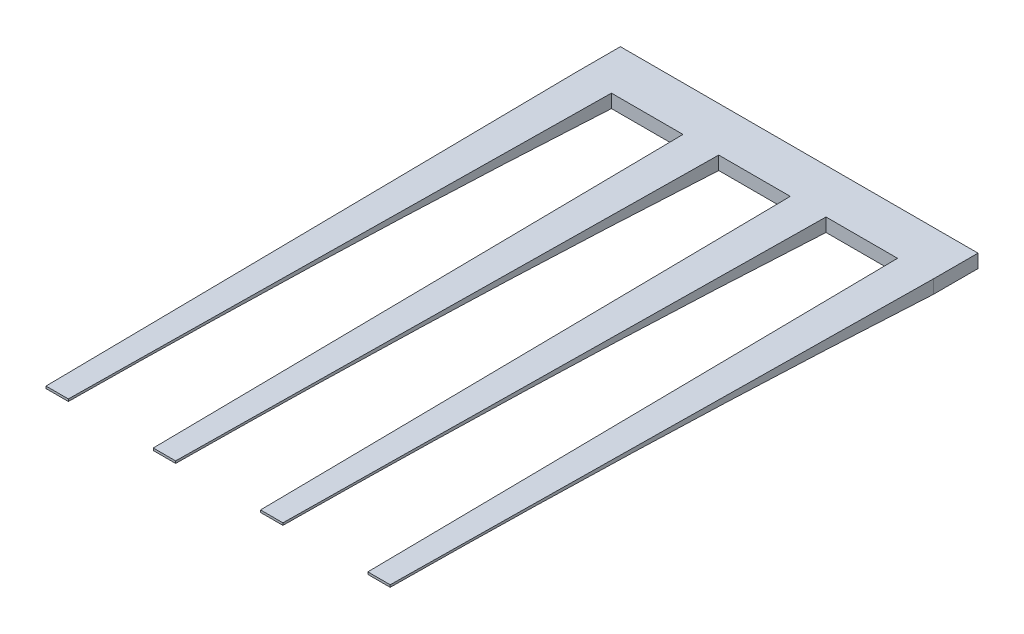
ISO-10303-21;
HEADER;
FILE_DESCRIPTION(('STEP AP214'),'2;1');
FILE_NAME('part.step','',(''),(''),'','','');
FILE_SCHEMA(('AUTOMOTIVE_DESIGN { 1 0 10303 214 1 1 1 1 }'));
ENDSEC;
DATA;
#1=APPLICATION_CONTEXT('core data for automotive mechanical design processes');
#2=APPLICATION_PROTOCOL_DEFINITION('international standard','automotive_design',2000,#1);
#3=PRODUCT_CONTEXT('',#1,'mechanical');
#4=PRODUCT('Part','Part','',(#3));
#5=PRODUCT_RELATED_PRODUCT_CATEGORY('part','',(#4));
#6=PRODUCT_DEFINITION_FORMATION('','',#4);
#7=PRODUCT_DEFINITION_CONTEXT('part definition',#1,'design');
#8=PRODUCT_DEFINITION('design','',#6,#7);
#9=PRODUCT_DEFINITION_SHAPE('','',#8);
#10=(LENGTH_UNIT() NAMED_UNIT(*) SI_UNIT(.MILLI.,.METRE.));
#11=(NAMED_UNIT(*) PLANE_ANGLE_UNIT() SI_UNIT($,.RADIAN.));
#12=(NAMED_UNIT(*) SI_UNIT($,.STERADIAN.) SOLID_ANGLE_UNIT());
#13=UNCERTAINTY_MEASURE_WITH_UNIT(LENGTH_MEASURE(1.E-05),#10,'distance_accuracy_value','');
#14=(GEOMETRIC_REPRESENTATION_CONTEXT(3) GLOBAL_UNCERTAINTY_ASSIGNED_CONTEXT((#13)) GLOBAL_UNIT_ASSIGNED_CONTEXT((#10,
#11,#12)) REPRESENTATION_CONTEXT('',''));
#15=CARTESIAN_POINT('',(0.,0.,0.));
#16=DIRECTION('',(0.,0.,1.));
#17=DIRECTION('',(1.,0.,0.));
#18=AXIS2_PLACEMENT_3D('',#15,#16,#17);
#19=CARTESIAN_POINT('',(0.,0.,200.));
#20=DIRECTION('',(0.,0.,1.));
#21=DIRECTION('',(1.,0.,0.));
#22=AXIS2_PLACEMENT_3D('',#19,#20,#21);
#23=PLANE('',#22);
#24=DIRECTION('',(0.,-1.,0.));
#25=VECTOR('',#24,1.);
#26=CARTESIAN_POINT('',(960.,0.,200.));
#27=LINE('',#26,#25);
#28=CARTESIAN_POINT('',(960.,0.,200.));
#29=VERTEX_POINT('',#28);
#30=CARTESIAN_POINT('',(960.,-60.,200.));
#31=VERTEX_POINT('',#30);
#32=EDGE_CURVE('E310',#29,#31,#27,.T.);
#33=ORIENTED_EDGE('',*,*,#32,.F.);
#34=DIRECTION('',(-1.,0.,0.));
#35=VECTOR('',#34,1.);
#36=CARTESIAN_POINT('',(0.,0.,200.));
#37=LINE('',#36,#35);
#38=CARTESIAN_POINT('',(640.,0.,200.));
#39=VERTEX_POINT('',#38);
#40=EDGE_CURVE('E209',#29,#39,#37,.T.);
#41=ORIENTED_EDGE('',*,*,#40,.T.);
#42=DIRECTION('',(0.,1.,0.));
#43=VECTOR('',#42,1.);
#44=CARTESIAN_POINT('',(640.,0.,200.));
#45=LINE('',#44,#43);
#46=CARTESIAN_POINT('',(640.,-60.,200.));
#47=VERTEX_POINT('',#46);
#48=EDGE_CURVE('E498',#47,#39,#45,.T.);
#49=ORIENTED_EDGE('',*,*,#48,.F.);
#50=DIRECTION('',(1.,0.,0.));
#51=VECTOR('',#50,1.);
#52=CARTESIAN_POINT('',(0.,-60.,200.));
#53=LINE('',#52,#51);
#54=EDGE_CURVE('E487',#47,#31,#53,.T.);
#55=ORIENTED_EDGE('',*,*,#54,.T.);
#56=EDGE_LOOP('',(#33,#41,#49,#55));
#57=FACE_BOUND('',#56,.T.);
#58=ADVANCED_FACE('F70',(#57),#23,.T.);
#59=DIRECTION('',(0.,-1.,0.));
#60=VECTOR('',#59,1.);
#61=CARTESIAN_POINT('',(480.,0.,200.));
#62=LINE('',#61,#60);
#63=CARTESIAN_POINT('',(480.,0.,200.));
#64=VERTEX_POINT('',#63);
#65=CARTESIAN_POINT('',(480.,-60.,200.));
#66=VERTEX_POINT('',#65);
#67=EDGE_CURVE('E556',#64,#66,#62,.T.);
#68=ORIENTED_EDGE('',*,*,#67,.F.);
#69=CARTESIAN_POINT('',(160.,0.,200.));
#70=VERTEX_POINT('',#69);
#71=EDGE_CURVE('E468',#64,#70,#37,.T.);
#72=ORIENTED_EDGE('',*,*,#71,.T.);
#73=DIRECTION('',(0.,1.,0.));
#74=VECTOR('',#73,1.);
#75=CARTESIAN_POINT('',(160.,0.,200.));
#76=LINE('',#75,#74);
#77=CARTESIAN_POINT('',(160.,-60.,200.));
#78=VERTEX_POINT('',#77);
#79=EDGE_CURVE('E661',#78,#70,#76,.T.);
#80=ORIENTED_EDGE('',*,*,#79,.F.);
#81=EDGE_CURVE('E484',#78,#66,#53,.T.);
#82=ORIENTED_EDGE('',*,*,#81,.T.);
#83=EDGE_LOOP('',(#68,#72,#80,#82));
#84=FACE_BOUND('',#83,.T.);
#85=ADVANCED_FACE('F698',(#84),#23,.T.);
#86=DIRECTION('',(0.,-1.,0.));
#87=VECTOR('',#86,1.);
#88=CARTESIAN_POINT('',(1440.,0.,200.));
#89=LINE('',#88,#87);
#90=CARTESIAN_POINT('',(1440.,0.,200.));
#91=VERTEX_POINT('',#90);
#92=CARTESIAN_POINT('',(1440.,-60.,200.));
#93=VERTEX_POINT('',#92);
#94=EDGE_CURVE('E212',#91,#93,#89,.T.);
#95=ORIENTED_EDGE('',*,*,#94,.F.);
#96=CARTESIAN_POINT('',(1120.,0.,200.));
#97=VERTEX_POINT('',#96);
#98=EDGE_CURVE('E200',#91,#97,#37,.T.);
#99=ORIENTED_EDGE('',*,*,#98,.T.);
#100=DIRECTION('',(0.,1.,0.));
#101=VECTOR('',#100,1.);
#102=CARTESIAN_POINT('',(1120.,0.,200.));
#103=LINE('',#102,#101);
#104=CARTESIAN_POINT('',(1120.,-60.,200.));
#105=VERTEX_POINT('',#104);
#106=EDGE_CURVE('E97',#105,#97,#103,.T.);
#107=ORIENTED_EDGE('',*,*,#106,.F.);
#108=EDGE_CURVE('E214',#105,#93,#53,.T.);
#109=ORIENTED_EDGE('',*,*,#108,.T.);
#110=EDGE_LOOP('',(#95,#99,#107,#109));
#111=FACE_BOUND('',#110,.T.);
#112=ADVANCED_FACE('F213',(#111),#23,.T.);
#113=CARTESIAN_POINT('',(0.,0.,200.));
#114=DIRECTION('',(1.,0.,0.));
#115=DIRECTION('',(0.,0.,-1.));
#116=AXIS2_PLACEMENT_3D('',#113,#114,#115);
#117=PLANE('',#116);
#118=DIRECTION('',(0.,-1.,0.));
#119=VECTOR('',#118,1.);
#120=CARTESIAN_POINT('',(0.,0.,0.));
#121=LINE('',#120,#119);
#122=CARTESIAN_POINT('',(0.,0.,0.));
#123=VERTEX_POINT('',#122);
#124=CARTESIAN_POINT('',(0.,-60.,0.));
#125=VERTEX_POINT('',#124);
#126=EDGE_CURVE('E475',#123,#125,#121,.T.);
#127=ORIENTED_EDGE('',*,*,#126,.T.);
#128=DIRECTION('',(0.,0.,-1.));
#129=VECTOR('',#128,1.);
#130=CARTESIAN_POINT('',(0.,-60.,200.));
#131=LINE('',#130,#129);
#132=CARTESIAN_POINT('',(0.,-60.,200.));
#133=VERTEX_POINT('',#132);
#134=EDGE_CURVE('E12',#133,#125,#131,.T.);
#135=ORIENTED_EDGE('',*,*,#134,.F.);
#136=DIRECTION('',(0.,-1.,0.));
#137=VECTOR('',#136,1.);
#138=CARTESIAN_POINT('',(0.,0.,200.));
#139=LINE('',#138,#137);
#140=CARTESIAN_POINT('',(-1.51961776495568E-12,0.,199.999999999757));
#141=VERTEX_POINT('',#140);
#142=EDGE_CURVE('E850',#141,#133,#139,.T.);
#143=ORIENTED_EDGE('',*,*,#142,.F.);
#144=DIRECTION('',(0.,0.,-1.));
#145=VECTOR('',#144,1.);
#146=CARTESIAN_POINT('',(0.,0.,200.));
#147=LINE('',#146,#145);
#148=EDGE_CURVE('E208',#141,#123,#147,.T.);
#149=ORIENTED_EDGE('',*,*,#148,.T.);
#150=EDGE_LOOP('',(#127,#135,#143,#149));
#151=FACE_BOUND('',#150,.T.);
#152=ADVANCED_FACE('F72',(#151),#117,.F.);
#153=CARTESIAN_POINT('',(0.,-60.,200.));
#154=DIRECTION('',(0.,1.,0.));
#155=DIRECTION('',(0.,0.,1.));
#156=AXIS2_PLACEMENT_3D('',#153,#154,#155);
#157=PLANE('',#156);
#158=DIRECTION('',(1.,0.,0.));
#159=VECTOR('',#158,1.);
#160=CARTESIAN_POINT('',(0.,-60.,0.));
#161=LINE('',#160,#159);
#162=CARTESIAN_POINT('',(1600.,-60.,0.));
#163=VERTEX_POINT('',#162);
#164=EDGE_CURVE('E719',#125,#163,#161,.T.);
#165=ORIENTED_EDGE('',*,*,#164,.T.);
#166=DIRECTION('',(0.,0.,-1.));
#167=VECTOR('',#166,1.);
#168=CARTESIAN_POINT('',(1600.,-60.,200.));
#169=LINE('',#168,#167);
#170=CARTESIAN_POINT('',(1600.,-60.,200.));
#171=VERTEX_POINT('',#170);
#172=EDGE_CURVE('E81',#171,#163,#169,.T.);
#173=ORIENTED_EDGE('',*,*,#172,.F.);
#174=DIRECTION('',(1.,0.,0.));
#175=VECTOR('',#174,1.);
#176=CARTESIAN_POINT('',(1440.,-60.,200.));
#177=LINE('',#176,#175);
#178=EDGE_CURVE('E89',#93,#171,#177,.T.);
#179=ORIENTED_EDGE('',*,*,#178,.F.);
#180=ORIENTED_EDGE('',*,*,#108,.F.);
#181=DIRECTION('',(1.,0.,0.));
#182=VECTOR('',#181,1.);
#183=CARTESIAN_POINT('',(960.,-60.,200.));
#184=LINE('',#183,#182);
#185=EDGE_CURVE('E366',#31,#105,#184,.T.);
#186=ORIENTED_EDGE('',*,*,#185,.F.);
#187=ORIENTED_EDGE('',*,*,#54,.F.);
#188=DIRECTION('',(1.,0.,0.));
#189=VECTOR('',#188,1.);
#190=CARTESIAN_POINT('',(480.,-60.,200.));
#191=LINE('',#190,#189);
#192=EDGE_CURVE('E494',#66,#47,#191,.T.);
#193=ORIENTED_EDGE('',*,*,#192,.F.);
#194=ORIENTED_EDGE('',*,*,#81,.F.);
#195=DIRECTION('',(1.,0.,0.));
#196=VECTOR('',#195,1.);
#197=CARTESIAN_POINT('',(0.,-60.,200.));
#198=LINE('',#197,#196);
#199=EDGE_CURVE('E483',#133,#78,#198,.T.);
#200=ORIENTED_EDGE('',*,*,#199,.F.);
#201=ORIENTED_EDGE('',*,*,#134,.T.);
#202=EDGE_LOOP('',(#165,#173,#179,#180,#186,#187,#193,#194,#200,#201));
#203=FACE_BOUND('',#202,.T.);
#204=ADVANCED_FACE('F500',(#203),#157,.F.);
#205=CARTESIAN_POINT('',(1600.,0.,200.));
#206=DIRECTION('',(-1.,0.,0.));
#207=DIRECTION('',(0.,0.,1.));
#208=AXIS2_PLACEMENT_3D('',#205,#206,#207);
#209=PLANE('',#208);
#210=DIRECTION('',(0.,1.,0.));
#211=VECTOR('',#210,1.);
#212=CARTESIAN_POINT('',(1600.,0.,0.));
#213=LINE('',#212,#211);
#214=CARTESIAN_POINT('',(1600.,0.,0.));
#215=VERTEX_POINT('',#214);
#216=EDGE_CURVE('E721',#163,#215,#213,.T.);
#217=ORIENTED_EDGE('',*,*,#216,.T.);
#218=DIRECTION('',(0.,0.,-1.));
#219=VECTOR('',#218,1.);
#220=CARTESIAN_POINT('',(1600.,0.,200.));
#221=LINE('',#220,#219);
#222=CARTESIAN_POINT('',(1600.,0.,200.));
#223=VERTEX_POINT('',#222);
#224=EDGE_CURVE('E1007',#223,#215,#221,.T.);
#225=ORIENTED_EDGE('',*,*,#224,.F.);
#226=CARTESIAN_POINT('',(1600.,-60.,200.));
#227=DIRECTION('',(0.,1.,0.));
#228=VECTOR('',#227,1.);
#229=LINE('',#226,#228);
#230=EDGE_CURVE('E482',#171,#223,#229,.T.);
#231=ORIENTED_EDGE('',*,*,#230,.F.);
#232=ORIENTED_EDGE('',*,*,#172,.T.);
#233=EDGE_LOOP('',(#217,#225,#231,#232));
#234=FACE_BOUND('',#233,.T.);
#235=ADVANCED_FACE('F444',(#234),#209,.F.);
#236=CARTESIAN_POINT('',(0.,0.,200.));
#237=DIRECTION('',(0.,-1.,0.));
#238=DIRECTION('',(0.,0.,-1.));
#239=AXIS2_PLACEMENT_3D('',#236,#237,#238);
#240=PLANE('',#239);
#241=DIRECTION('',(-1.,0.,0.));
#242=VECTOR('',#241,1.);
#243=CARTESIAN_POINT('',(0.,0.,0.));
#244=LINE('',#243,#242);
#245=EDGE_CURVE('E851',#215,#123,#244,.T.);
#246=ORIENTED_EDGE('',*,*,#245,.T.);
#247=ORIENTED_EDGE('',*,*,#148,.F.);
#248=DIRECTION('',(0.012499023551926,0.,0.999921884154082));
#249=VECTOR('',#248,1.);
#250=CARTESIAN_POINT('',(14.9982918815874,0.,1399.86335052699));
#251=LINE('',#250,#249);
#252=CARTESIAN_POINT('',(30.,0.,2600.));
#253=VERTEX_POINT('',#252);
#254=EDGE_CURVE('E794',#141,#253,#251,.T.);
#255=ORIENTED_EDGE('',*,*,#254,.T.);
#256=DIRECTION('',(-1.,0.,0.));
#257=VECTOR('',#256,1.);
#258=CARTESIAN_POINT('',(30.,0.,2600.));
#259=LINE('',#258,#257);
#260=CARTESIAN_POINT('',(130.,0.,2600.));
#261=VERTEX_POINT('',#260);
#262=EDGE_CURVE('E720',#261,#253,#259,.T.);
#263=ORIENTED_EDGE('',*,*,#262,.F.);
#264=DIRECTION('',(0.012499023551926,0.,-0.999921884154082));
#265=VECTOR('',#264,1.);
#266=CARTESIAN_POINT('',(145.001708118413,0.,1399.86335052699));
#267=LINE('',#266,#265);
#268=EDGE_CURVE('E625',#261,#70,#267,.T.);
#269=ORIENTED_EDGE('',*,*,#268,.T.);
#270=ORIENTED_EDGE('',*,*,#71,.F.);
#271=DIRECTION('',(0.012499023551926,0.,0.999921884154082));
#272=VECTOR('',#271,1.);
#273=CARTESIAN_POINT('',(494.998291881587,0.,1399.86335052699));
#274=LINE('',#273,#272);
#275=CARTESIAN_POINT('',(510.,0.,2600.));
#276=VERTEX_POINT('',#275);
#277=EDGE_CURVE('E577',#64,#276,#274,.T.);
#278=ORIENTED_EDGE('',*,*,#277,.T.);
#279=DIRECTION('',(-1.,0.,0.));
#280=VECTOR('',#279,1.);
#281=CARTESIAN_POINT('',(510.,0.,2600.));
#282=LINE('',#281,#280);
#283=CARTESIAN_POINT('',(610.,0.,2600.));
#284=VERTEX_POINT('',#283);
#285=EDGE_CURVE('E603',#284,#276,#282,.T.);
#286=ORIENTED_EDGE('',*,*,#285,.F.);
#287=DIRECTION('',(0.012499023551926,0.,-0.999921884154082));
#288=VECTOR('',#287,1.);
#289=CARTESIAN_POINT('',(625.001708118413,0.,1399.86335052699));
#290=LINE('',#289,#288);
#291=EDGE_CURVE('E570',#284,#39,#290,.T.);
#292=ORIENTED_EDGE('',*,*,#291,.T.);
#293=ORIENTED_EDGE('',*,*,#40,.F.);
#294=DIRECTION('',(0.012499023551926,0.,0.999921884154082));
#295=VECTOR('',#294,1.);
#296=CARTESIAN_POINT('',(974.998291881587,0.,1399.86335052699));
#297=LINE('',#296,#295);
#298=CARTESIAN_POINT('',(990.,0.,2600.));
#299=VERTEX_POINT('',#298);
#300=EDGE_CURVE('E343',#29,#299,#297,.T.);
#301=ORIENTED_EDGE('',*,*,#300,.T.);
#302=DIRECTION('',(-1.,0.,0.));
#303=VECTOR('',#302,1.);
#304=CARTESIAN_POINT('',(990.,0.,2600.));
#305=LINE('',#304,#303);
#306=CARTESIAN_POINT('',(1090.,0.,2600.));
#307=VERTEX_POINT('',#306);
#308=EDGE_CURVE('E429',#307,#299,#305,.T.);
#309=ORIENTED_EDGE('',*,*,#308,.F.);
#310=DIRECTION('',(0.012499023551926,0.,-0.999921884154082));
#311=VECTOR('',#310,1.);
#312=CARTESIAN_POINT('',(1105.00170811841,0.,1399.86335052699));
#313=LINE('',#312,#311);
#314=EDGE_CURVE('E207',#307,#97,#313,.T.);
#315=ORIENTED_EDGE('',*,*,#314,.T.);
#316=ORIENTED_EDGE('',*,*,#98,.F.);
#317=DIRECTION('',(0.012499023551926,0.,0.999921884154082));
#318=VECTOR('',#317,1.);
#319=CARTESIAN_POINT('',(1454.99829188159,0.,1399.86335052699));
#320=LINE('',#319,#318);
#321=CARTESIAN_POINT('',(1470.,0.,2600.));
#322=VERTEX_POINT('',#321);
#323=EDGE_CURVE('E205',#91,#322,#320,.T.);
#324=ORIENTED_EDGE('',*,*,#323,.T.);
#325=DIRECTION('',(-1.,0.,0.));
#326=VECTOR('',#325,1.);
#327=CARTESIAN_POINT('',(1470.,0.,2600.));
#328=LINE('',#327,#326);
#329=CARTESIAN_POINT('',(1570.,0.,2600.));
#330=VERTEX_POINT('',#329);
#331=EDGE_CURVE('E306',#330,#322,#328,.T.);
#332=ORIENTED_EDGE('',*,*,#331,.F.);
#333=DIRECTION('',(0.012499023551926,0.,-0.999921884154082));
#334=VECTOR('',#333,1.);
#335=CARTESIAN_POINT('',(1585.00170811841,0.,1399.86335052699));
#336=LINE('',#335,#334);
#337=EDGE_CURVE('E225',#330,#223,#336,.T.);
#338=ORIENTED_EDGE('',*,*,#337,.T.);
#339=ORIENTED_EDGE('',*,*,#224,.T.);
#340=EDGE_LOOP('',(#246,#247,#255,#263,#269,#270,#278,#286,#292,#293,#301,#309,#315,#316,#324,
#332,#338,#339));
#341=FACE_BOUND('',#340,.T.);
#342=ADVANCED_FACE('F202',(#341),#240,.F.);
#343=CARTESIAN_POINT('',(0.,0.,0.));
#344=DIRECTION('',(0.,0.,1.));
#345=DIRECTION('',(1.,0.,0.));
#346=AXIS2_PLACEMENT_3D('',#343,#344,#345);
#347=PLANE('',#346);
#348=ORIENTED_EDGE('',*,*,#126,.F.);
#349=ORIENTED_EDGE('',*,*,#245,.F.);
#350=ORIENTED_EDGE('',*,*,#216,.F.);
#351=ORIENTED_EDGE('',*,*,#164,.F.);
#352=EDGE_LOOP('',(#348,#349,#350,#351));
#353=FACE_BOUND('',#352,.T.);
#354=ADVANCED_FACE('F443',(#353),#347,.F.);
#355=CARTESIAN_POINT('',(0.,0.,2600.));
#356=DIRECTION('',(0.,0.,1.));
#357=DIRECTION('',(1.,0.,0.));
#358=AXIS2_PLACEMENT_3D('',#355,#356,#357);
#359=PLANE('',#358);
#360=DIRECTION('',(0.,-1.,0.));
#361=VECTOR('',#360,1.);
#362=CARTESIAN_POINT('',(30.,0.,2600.));
#363=LINE('',#362,#361);
#364=CARTESIAN_POINT('',(30.,-10.,2600.));
#365=VERTEX_POINT('',#364);
#366=EDGE_CURVE('E745',#253,#365,#363,.T.);
#367=ORIENTED_EDGE('',*,*,#366,.T.);
#368=DIRECTION('',(1.,0.,0.));
#369=VECTOR('',#368,1.);
#370=CARTESIAN_POINT('',(30.,-10.,2600.));
#371=LINE('',#370,#369);
#372=CARTESIAN_POINT('',(130.,-10.,2600.));
#373=VERTEX_POINT('',#372);
#374=EDGE_CURVE('E730',#365,#373,#371,.T.);
#375=ORIENTED_EDGE('',*,*,#374,.T.);
#376=DIRECTION('',(0.,1.,0.));
#377=VECTOR('',#376,1.);
#378=CARTESIAN_POINT('',(130.,0.,2600.));
#379=LINE('',#378,#377);
#380=EDGE_CURVE('E722',#373,#261,#379,.T.);
#381=ORIENTED_EDGE('',*,*,#380,.T.);
#382=ORIENTED_EDGE('',*,*,#262,.T.);
#383=EDGE_LOOP('',(#367,#375,#381,#382));
#384=FACE_BOUND('',#383,.T.);
#385=ADVANCED_FACE('F746',(#384),#359,.T.);
#386=CARTESIAN_POINT('',(0.,0.,200.));
#387=DIRECTION('',(-0.999921884154081,0.,0.012499023551926));
#388=DIRECTION('',(0.,-1.,0.));
#389=AXIS2_PLACEMENT_3D('',#386,#387,#388);
#390=PLANE('',#389);
#391=ORIENTED_EDGE('',*,*,#142,.T.);
#392=CARTESIAN_POINT('',(0.,-60.,200.));
#393=CARTESIAN_POINT('',(4.99869868480411,-41.6688355253265,599.895894784329));
#394=CARTESIAN_POINT('',(14.9990238239833,-15.0016268303537,1399.92190591866));
#395=CARTESIAN_POINT('',(24.9986986848041,-8.33550219199315,2199.89589478433));
#396=CARTESIAN_POINT('',(30.,-10.,2600.));
#397=B_SPLINE_CURVE_WITH_KNOTS('',3,(#392,#393,#394,#395,#396),.UNSPECIFIED.,.F.,.F.,(4,1,4),
(0.,0.500056937280421,1.),.UNSPECIFIED.);
#398=EDGE_CURVE('E790',#133,#365,#397,.T.);
#399=ORIENTED_EDGE('',*,*,#398,.T.);
#400=ORIENTED_EDGE('',*,*,#366,.F.);
#401=ORIENTED_EDGE('',*,*,#254,.F.);
#402=EDGE_LOOP('',(#391,#399,#400,#401));
#403=FACE_BOUND('',#402,.T.);
#404=ADVANCED_FACE('F643',(#403),#390,.T.);
#405=CARTESIAN_POINT('',(160.,-60.,200.));
#406=DIRECTION('',(0.999921884154081,0.,0.012499023551926));
#407=DIRECTION('',(0.,1.,0.));
#408=AXIS2_PLACEMENT_3D('',#405,#406,#407);
#409=PLANE('',#408);
#410=ORIENTED_EDGE('',*,*,#79,.T.);
#411=ORIENTED_EDGE('',*,*,#268,.F.);
#412=ORIENTED_EDGE('',*,*,#380,.F.);
#413=CARTESIAN_POINT('',(160.,-60.,200.));
#414=CARTESIAN_POINT('',(155.001301315196,-41.6688355253265,599.895894784329));
#415=CARTESIAN_POINT('',(145.000976176017,-15.0016268303537,1399.92190591866));
#416=CARTESIAN_POINT('',(135.001301315196,-8.33550219199315,2199.89589478433));
#417=CARTESIAN_POINT('',(130.,-10.,2600.));
#418=B_SPLINE_CURVE_WITH_KNOTS('',3,(#413,#414,#415,#416,#417),.UNSPECIFIED.,.F.,.F.,(4,1,4),
(0.,0.500056937280421,1.),.UNSPECIFIED.);
#419=EDGE_CURVE('E788',#78,#373,#418,.T.);
#420=ORIENTED_EDGE('',*,*,#419,.F.);
#421=EDGE_LOOP('',(#410,#411,#412,#420));
#422=FACE_BOUND('',#421,.T.);
#423=ADVANCED_FACE('F829',(#422),#409,.T.);
#424=CARTESIAN_POINT('',(0.,-60.,200.));
#425=CARTESIAN_POINT('',(4.99869868480411,-41.6688355253265,599.895894784329));
#426=CARTESIAN_POINT('',(14.9990238239833,-15.0016268303537,1399.92190591866));
#427=CARTESIAN_POINT('',(24.9986986848041,-8.33550219199315,2199.89589478433));
#428=CARTESIAN_POINT('',(30.,-10.,2600.));
#429=CARTESIAN_POINT('',(53.3333333333333,-60.,200.));
#430=CARTESIAN_POINT('',(54.999566228268,-41.6688355253265,599.895894784329));
#431=CARTESIAN_POINT('',(58.3330079413278,-15.0016268303537,1399.92190591866));
#432=CARTESIAN_POINT('',(61.6662328949347,-8.33550219199315,2199.89589478433));
#433=CARTESIAN_POINT('',(63.3333333333333,-10.,2600.));
#434=CARTESIAN_POINT('',(106.666666666667,-60.,200.));
#435=CARTESIAN_POINT('',(105.000433771732,-41.6688355253265,599.895894784329));
#436=CARTESIAN_POINT('',(101.666992058672,-15.0016268303537,1399.92190591866));
#437=CARTESIAN_POINT('',(98.3337671050653,-8.33550219199315,2199.89589478433));
#438=CARTESIAN_POINT('',(96.6666666666667,-10.,2600.));
#439=CARTESIAN_POINT('',(160.,-60.,200.));
#440=CARTESIAN_POINT('',(155.001301315196,-41.6688355253265,599.895894784329));
#441=CARTESIAN_POINT('',(145.000976176017,-15.0016268303537,1399.92190591866));
#442=CARTESIAN_POINT('',(135.001301315196,-8.33550219199315,2199.89589478433));
#443=CARTESIAN_POINT('',(130.,-10.,2600.));
#444=B_SPLINE_SURFACE_WITH_KNOTS('',3,3,((#424,#425,#426,#427,#428),(#429,#430,#431,#432,#433),
(#434,#435,#436,#437,#438),(#439,#440,#441,#442,#443)),.UNSPECIFIED.,.F.,.F.,.F.,(4,4),(4,1,4),
(0.,1.),(0.,0.500056937280421,1.),.UNSPECIFIED.);
#445=ORIENTED_EDGE('',*,*,#199,.T.);
#446=ORIENTED_EDGE('',*,*,#419,.T.);
#447=ORIENTED_EDGE('',*,*,#374,.F.);
#448=ORIENTED_EDGE('',*,*,#398,.F.);
#449=EDGE_LOOP('',(#445,#446,#447,#448));
#450=FACE_BOUND('',#449,.T.);
#451=ADVANCED_FACE('F638',(#450),#444,.T.);
#452=CARTESIAN_POINT('',(480.,0.,2600.));
#453=DIRECTION('',(0.,0.,1.));
#454=DIRECTION('',(1.,0.,0.));
#455=AXIS2_PLACEMENT_3D('',#452,#453,#454);
#456=PLANE('',#455);
#457=DIRECTION('',(0.,-1.,0.));
#458=VECTOR('',#457,1.);
#459=CARTESIAN_POINT('',(510.,0.,2600.));
#460=LINE('',#459,#458);
#461=CARTESIAN_POINT('',(510.,-10.,2600.));
#462=VERTEX_POINT('',#461);
#463=EDGE_CURVE('E615',#276,#462,#460,.T.);
#464=ORIENTED_EDGE('',*,*,#463,.T.);
#465=DIRECTION('',(1.,0.,0.));
#466=VECTOR('',#465,1.);
#467=CARTESIAN_POINT('',(510.,-10.,2600.));
#468=LINE('',#467,#466);
#469=CARTESIAN_POINT('',(610.,-10.,2600.));
#470=VERTEX_POINT('',#469);
#471=EDGE_CURVE('E604',#462,#470,#468,.T.);
#472=ORIENTED_EDGE('',*,*,#471,.T.);
#473=DIRECTION('',(0.,1.,0.));
#474=VECTOR('',#473,1.);
#475=CARTESIAN_POINT('',(610.,0.,2600.));
#476=LINE('',#475,#474);
#477=EDGE_CURVE('E599',#470,#284,#476,.T.);
#478=ORIENTED_EDGE('',*,*,#477,.T.);
#479=ORIENTED_EDGE('',*,*,#285,.T.);
#480=EDGE_LOOP('',(#464,#472,#478,#479));
#481=FACE_BOUND('',#480,.T.);
#482=ADVANCED_FACE('F627',(#481),#456,.T.);
#483=CARTESIAN_POINT('',(480.,0.,200.));
#484=DIRECTION('',(-0.999921884154081,0.,0.012499023551926));
#485=DIRECTION('',(0.,-1.,0.));
#486=AXIS2_PLACEMENT_3D('',#483,#484,#485);
#487=PLANE('',#486);
#488=ORIENTED_EDGE('',*,*,#67,.T.);
#489=CARTESIAN_POINT('',(480.,-60.,200.));
#490=CARTESIAN_POINT('',(484.998698684804,-41.6688355253265,599.895894784329));
#491=CARTESIAN_POINT('',(494.999023823983,-15.0016268303537,1399.92190591866));
#492=CARTESIAN_POINT('',(504.998698684804,-8.33550219199315,2199.89589478433));
#493=CARTESIAN_POINT('',(510.,-10.,2600.));
#494=B_SPLINE_CURVE_WITH_KNOTS('',3,(#489,#490,#491,#492,#493),.UNSPECIFIED.,.F.,.F.,(4,1,4),
(0.,0.500056937280421,1.),.UNSPECIFIED.);
#495=EDGE_CURVE('E665',#66,#462,#494,.T.);
#496=ORIENTED_EDGE('',*,*,#495,.T.);
#497=ORIENTED_EDGE('',*,*,#463,.F.);
#498=ORIENTED_EDGE('',*,*,#277,.F.);
#499=EDGE_LOOP('',(#488,#496,#497,#498));
#500=FACE_BOUND('',#499,.T.);
#501=ADVANCED_FACE('F637',(#500),#487,.T.);
#502=CARTESIAN_POINT('',(640.,-60.,200.));
#503=DIRECTION('',(0.999921884154081,0.,0.012499023551926));
#504=DIRECTION('',(0.,1.,0.));
#505=AXIS2_PLACEMENT_3D('',#502,#503,#504);
#506=PLANE('',#505);
#507=ORIENTED_EDGE('',*,*,#48,.T.);
#508=ORIENTED_EDGE('',*,*,#291,.F.);
#509=ORIENTED_EDGE('',*,*,#477,.F.);
#510=CARTESIAN_POINT('',(640.,-60.,200.));
#511=CARTESIAN_POINT('',(635.001301315196,-41.6688355253265,599.895894784329));
#512=CARTESIAN_POINT('',(625.000976176017,-15.0016268303537,1399.92190591866));
#513=CARTESIAN_POINT('',(615.001301315196,-8.33550219199315,2199.89589478433));
#514=CARTESIAN_POINT('',(610.,-10.,2600.));
#515=B_SPLINE_CURVE_WITH_KNOTS('',3,(#510,#511,#512,#513,#514),.UNSPECIFIED.,.F.,.F.,(4,1,4),
(0.,0.500056937280421,1.),.UNSPECIFIED.);
#516=EDGE_CURVE('E576',#47,#470,#515,.T.);
#517=ORIENTED_EDGE('',*,*,#516,.F.);
#518=EDGE_LOOP('',(#507,#508,#509,#517));
#519=FACE_BOUND('',#518,.T.);
#520=ADVANCED_FACE('F574',(#519),#506,.T.);
#521=CARTESIAN_POINT('',(480.,-60.,200.));
#522=CARTESIAN_POINT('',(484.998698684804,-41.6688355253265,599.895894784329));
#523=CARTESIAN_POINT('',(494.999023823983,-15.0016268303537,1399.92190591866));
#524=CARTESIAN_POINT('',(504.998698684804,-8.33550219199315,2199.89589478433));
#525=CARTESIAN_POINT('',(510.,-10.,2600.));
#526=CARTESIAN_POINT('',(533.333333333333,-60.,200.));
#527=CARTESIAN_POINT('',(534.999566228268,-41.6688355253265,599.895894784329));
#528=CARTESIAN_POINT('',(538.333007941328,-15.0016268303537,1399.92190591866));
#529=CARTESIAN_POINT('',(541.666232894935,-8.33550219199315,2199.89589478433));
#530=CARTESIAN_POINT('',(543.333333333333,-10.,2600.));
#531=CARTESIAN_POINT('',(586.666666666667,-60.,200.));
#532=CARTESIAN_POINT('',(585.000433771732,-41.6688355253265,599.895894784329));
#533=CARTESIAN_POINT('',(581.666992058672,-15.0016268303537,1399.92190591866));
#534=CARTESIAN_POINT('',(578.333767105065,-8.33550219199315,2199.89589478433));
#535=CARTESIAN_POINT('',(576.666666666667,-10.,2600.));
#536=CARTESIAN_POINT('',(640.,-60.,200.));
#537=CARTESIAN_POINT('',(635.001301315196,-41.6688355253265,599.895894784329));
#538=CARTESIAN_POINT('',(625.000976176017,-15.0016268303537,1399.92190591866));
#539=CARTESIAN_POINT('',(615.001301315196,-8.33550219199315,2199.89589478433));
#540=CARTESIAN_POINT('',(610.,-10.,2600.));
#541=B_SPLINE_SURFACE_WITH_KNOTS('',3,3,((#521,#522,#523,#524,#525),(#526,#527,#528,#529,#530),
(#531,#532,#533,#534,#535),(#536,#537,#538,#539,#540)),.UNSPECIFIED.,.F.,.F.,.F.,(4,4),(4,1,4),
(0.,1.),(0.,0.500056937280421,1.),.UNSPECIFIED.);
#542=ORIENTED_EDGE('',*,*,#192,.T.);
#543=ORIENTED_EDGE('',*,*,#516,.T.);
#544=ORIENTED_EDGE('',*,*,#471,.F.);
#545=ORIENTED_EDGE('',*,*,#495,.F.);
#546=EDGE_LOOP('',(#542,#543,#544,#545));
#547=FACE_BOUND('',#546,.T.);
#548=ADVANCED_FACE('F639',(#547),#541,.T.);
#549=CARTESIAN_POINT('',(960.,0.,2600.));
#550=DIRECTION('',(0.,0.,1.));
#551=DIRECTION('',(1.,0.,0.));
#552=AXIS2_PLACEMENT_3D('',#549,#550,#551);
#553=PLANE('',#552);
#554=DIRECTION('',(0.,-1.,0.));
#555=VECTOR('',#554,1.);
#556=CARTESIAN_POINT('',(990.,0.,2600.));
#557=LINE('',#556,#555);
#558=CARTESIAN_POINT('',(990.,-10.,2600.));
#559=VERTEX_POINT('',#558);
#560=EDGE_CURVE('E534',#299,#559,#557,.T.);
#561=ORIENTED_EDGE('',*,*,#560,.T.);
#562=DIRECTION('',(1.,0.,0.));
#563=VECTOR('',#562,1.);
#564=CARTESIAN_POINT('',(990.,-10.,2600.));
#565=LINE('',#564,#563);
#566=CARTESIAN_POINT('',(1090.,-10.,2600.));
#567=VERTEX_POINT('',#566);
#568=EDGE_CURVE('E531',#559,#567,#565,.T.);
#569=ORIENTED_EDGE('',*,*,#568,.T.);
#570=DIRECTION('',(0.,1.,0.));
#571=VECTOR('',#570,1.);
#572=CARTESIAN_POINT('',(1090.,0.,2600.));
#573=LINE('',#572,#571);
#574=EDGE_CURVE('E410',#567,#307,#573,.T.);
#575=ORIENTED_EDGE('',*,*,#574,.T.);
#576=ORIENTED_EDGE('',*,*,#308,.T.);
#577=EDGE_LOOP('',(#561,#569,#575,#576));
#578=FACE_BOUND('',#577,.T.);
#579=ADVANCED_FACE('F387',(#578),#553,.T.);
#580=CARTESIAN_POINT('',(960.,0.,200.));
#581=DIRECTION('',(-0.999921884154081,0.,0.012499023551926));
#582=DIRECTION('',(0.,-1.,0.));
#583=AXIS2_PLACEMENT_3D('',#580,#581,#582);
#584=PLANE('',#583);
#585=ORIENTED_EDGE('',*,*,#32,.T.);
#586=CARTESIAN_POINT('',(960.,-60.,200.));
#587=CARTESIAN_POINT('',(964.998698684804,-41.6688355253265,599.895894784329));
#588=CARTESIAN_POINT('',(974.999023823983,-15.0016268303537,1399.92190591866));
#589=CARTESIAN_POINT('',(984.998698684804,-8.33550219199315,2199.89589478433));
#590=CARTESIAN_POINT('',(990.,-10.,2600.));
#591=B_SPLINE_CURVE_WITH_KNOTS('',3,(#586,#587,#588,#589,#590),.UNSPECIFIED.,.F.,.F.,(4,1,4),
(0.,0.500056937280421,1.),.UNSPECIFIED.);
#592=EDGE_CURVE('E348',#31,#559,#591,.T.);
#593=ORIENTED_EDGE('',*,*,#592,.T.);
#594=ORIENTED_EDGE('',*,*,#560,.F.);
#595=ORIENTED_EDGE('',*,*,#300,.F.);
#596=EDGE_LOOP('',(#585,#593,#594,#595));
#597=FACE_BOUND('',#596,.T.);
#598=ADVANCED_FACE('F526',(#597),#584,.T.);
#599=CARTESIAN_POINT('',(1120.,-60.,200.));
#600=DIRECTION('',(0.999921884154081,0.,0.012499023551926));
#601=DIRECTION('',(0.,1.,0.));
#602=AXIS2_PLACEMENT_3D('',#599,#600,#601);
#603=PLANE('',#602);
#604=ORIENTED_EDGE('',*,*,#106,.T.);
#605=ORIENTED_EDGE('',*,*,#314,.F.);
#606=ORIENTED_EDGE('',*,*,#574,.F.);
#607=CARTESIAN_POINT('',(1120.,-60.,200.));
#608=CARTESIAN_POINT('',(1115.0013013152,-41.6688355253265,599.895894784329));
#609=CARTESIAN_POINT('',(1105.00097617602,-15.0016268303537,1399.92190591866));
#610=CARTESIAN_POINT('',(1095.0013013152,-8.33550219199315,2199.89589478433));
#611=CARTESIAN_POINT('',(1090.,-10.,2600.));
#612=B_SPLINE_CURVE_WITH_KNOTS('',3,(#607,#608,#609,#610,#611),.UNSPECIFIED.,.F.,.F.,(4,1,4),
(0.,0.500056937280421,1.),.UNSPECIFIED.);
#613=EDGE_CURVE('E353',#105,#567,#612,.T.);
#614=ORIENTED_EDGE('',*,*,#613,.F.);
#615=EDGE_LOOP('',(#604,#605,#606,#614));
#616=FACE_BOUND('',#615,.T.);
#617=ADVANCED_FACE('F385',(#616),#603,.T.);
#618=CARTESIAN_POINT('',(960.,-60.,200.));
#619=CARTESIAN_POINT('',(964.998698684804,-41.6688355253265,599.895894784329));
#620=CARTESIAN_POINT('',(974.999023823983,-15.0016268303537,1399.92190591866));
#621=CARTESIAN_POINT('',(984.998698684804,-8.33550219199315,2199.89589478433));
#622=CARTESIAN_POINT('',(990.,-10.,2600.));
#623=CARTESIAN_POINT('',(1013.33333333333,-60.,200.));
#624=CARTESIAN_POINT('',(1014.99956622827,-41.6688355253265,599.895894784329));
#625=CARTESIAN_POINT('',(1018.33300794133,-15.0016268303537,1399.92190591866));
#626=CARTESIAN_POINT('',(1021.66623289493,-8.33550219199315,2199.89589478433));
#627=CARTESIAN_POINT('',(1023.33333333333,-10.,2600.));
#628=CARTESIAN_POINT('',(1066.66666666667,-60.,200.));
#629=CARTESIAN_POINT('',(1065.00043377173,-41.6688355253265,599.895894784329));
#630=CARTESIAN_POINT('',(1061.66699205867,-15.0016268303537,1399.92190591866));
#631=CARTESIAN_POINT('',(1058.33376710507,-8.33550219199315,2199.89589478433));
#632=CARTESIAN_POINT('',(1056.66666666667,-10.,2600.));
#633=CARTESIAN_POINT('',(1120.,-60.,200.));
#634=CARTESIAN_POINT('',(1115.0013013152,-41.6688355253265,599.895894784329));
#635=CARTESIAN_POINT('',(1105.00097617602,-15.0016268303537,1399.92190591866));
#636=CARTESIAN_POINT('',(1095.0013013152,-8.33550219199315,2199.89589478433));
#637=CARTESIAN_POINT('',(1090.,-10.,2600.));
#638=B_SPLINE_SURFACE_WITH_KNOTS('',3,3,((#618,#619,#620,#621,#622),(#623,#624,#625,#626,#627),
(#628,#629,#630,#631,#632),(#633,#634,#635,#636,#637)),.UNSPECIFIED.,.F.,.F.,.F.,(4,4),(4,1,4),
(0.,1.),(0.,0.500056937280421,1.),.UNSPECIFIED.);
#639=ORIENTED_EDGE('',*,*,#185,.T.);
#640=ORIENTED_EDGE('',*,*,#613,.T.);
#641=ORIENTED_EDGE('',*,*,#568,.F.);
#642=ORIENTED_EDGE('',*,*,#592,.F.);
#643=EDGE_LOOP('',(#639,#640,#641,#642));
#644=FACE_BOUND('',#643,.T.);
#645=ADVANCED_FACE('F373',(#644),#638,.T.);
#646=CARTESIAN_POINT('',(1440.,0.,2600.));
#647=DIRECTION('',(0.,0.,1.));
#648=DIRECTION('',(1.,0.,0.));
#649=AXIS2_PLACEMENT_3D('',#646,#647,#648);
#650=PLANE('',#649);
#651=DIRECTION('',(0.,-1.,0.));
#652=VECTOR('',#651,1.);
#653=CARTESIAN_POINT('',(1470.,0.,2600.));
#654=LINE('',#653,#652);
#655=CARTESIAN_POINT('',(1470.,-10.,2600.));
#656=VERTEX_POINT('',#655);
#657=EDGE_CURVE('E222',#322,#656,#654,.T.);
#658=ORIENTED_EDGE('',*,*,#657,.T.);
#659=DIRECTION('',(1.,0.,0.));
#660=VECTOR('',#659,1.);
#661=CARTESIAN_POINT('',(1470.,-10.,2600.));
#662=LINE('',#661,#660);
#663=CARTESIAN_POINT('',(1570.,-10.,2600.));
#664=VERTEX_POINT('',#663);
#665=EDGE_CURVE('E314',#656,#664,#662,.T.);
#666=ORIENTED_EDGE('',*,*,#665,.T.);
#667=DIRECTION('',(0.,1.,0.));
#668=VECTOR('',#667,1.);
#669=CARTESIAN_POINT('',(1570.,0.,2600.));
#670=LINE('',#669,#668);
#671=EDGE_CURVE('E290',#664,#330,#670,.T.);
#672=ORIENTED_EDGE('',*,*,#671,.T.);
#673=ORIENTED_EDGE('',*,*,#331,.T.);
#674=EDGE_LOOP('',(#658,#666,#672,#673));
#675=FACE_BOUND('',#674,.T.);
#676=ADVANCED_FACE('F267',(#675),#650,.T.);
#677=CARTESIAN_POINT('',(1440.,0.,200.));
#678=DIRECTION('',(-0.999921884154081,0.,0.012499023551926));
#679=DIRECTION('',(0.,-1.,0.));
#680=AXIS2_PLACEMENT_3D('',#677,#678,#679);
#681=PLANE('',#680);
#682=ORIENTED_EDGE('',*,*,#94,.T.);
#683=CARTESIAN_POINT('',(1440.,-60.,200.));
#684=CARTESIAN_POINT('',(1444.9986986848,-41.6688355253265,599.895894784329));
#685=CARTESIAN_POINT('',(1454.99902382398,-15.0016268303537,1399.92190591866));
#686=CARTESIAN_POINT('',(1464.9986986848,-8.33550219199315,2199.89589478433));
#687=CARTESIAN_POINT('',(1470.,-10.,2600.));
#688=B_SPLINE_CURVE_WITH_KNOTS('',3,(#683,#684,#685,#686,#687),.UNSPECIFIED.,.F.,.F.,(4,1,4),
(0.,0.500056937280421,1.),.UNSPECIFIED.);
#689=EDGE_CURVE('E224',#93,#656,#688,.T.);
#690=ORIENTED_EDGE('',*,*,#689,.T.);
#691=ORIENTED_EDGE('',*,*,#657,.F.);
#692=ORIENTED_EDGE('',*,*,#323,.F.);
#693=EDGE_LOOP('',(#682,#690,#691,#692));
#694=FACE_BOUND('',#693,.T.);
#695=ADVANCED_FACE('F220',(#694),#681,.T.);
#696=CARTESIAN_POINT('',(1600.,-60.,200.));
#697=DIRECTION('',(0.999921884154081,0.,0.012499023551926));
#698=DIRECTION('',(0.,1.,0.));
#699=AXIS2_PLACEMENT_3D('',#696,#697,#698);
#700=PLANE('',#699);
#701=ORIENTED_EDGE('',*,*,#230,.T.);
#702=ORIENTED_EDGE('',*,*,#337,.F.);
#703=ORIENTED_EDGE('',*,*,#671,.F.);
#704=CARTESIAN_POINT('',(1600.,-60.,200.));
#705=CARTESIAN_POINT('',(1595.0013013152,-41.6688355253265,599.895894784329));
#706=CARTESIAN_POINT('',(1585.00097617602,-15.0016268303537,1399.92190591866));
#707=CARTESIAN_POINT('',(1575.0013013152,-8.33550219199315,2199.89589478433));
#708=CARTESIAN_POINT('',(1570.,-10.,2600.));
#709=B_SPLINE_CURVE_WITH_KNOTS('',3,(#704,#705,#706,#707,#708),.UNSPECIFIED.,.F.,.F.,(4,1,4),
(0.,0.500056937280421,1.),.UNSPECIFIED.);
#710=EDGE_CURVE('E227',#171,#664,#709,.T.);
#711=ORIENTED_EDGE('',*,*,#710,.F.);
#712=EDGE_LOOP('',(#701,#702,#703,#711));
#713=FACE_BOUND('',#712,.T.);
#714=ADVANCED_FACE('F264',(#713),#700,.T.);
#715=CARTESIAN_POINT('',(1440.,-60.,200.));
#716=CARTESIAN_POINT('',(1444.9986986848,-41.6688355253265,599.895894784329));
#717=CARTESIAN_POINT('',(1454.99902382398,-15.0016268303537,1399.92190591866));
#718=CARTESIAN_POINT('',(1464.9986986848,-8.33550219199315,2199.89589478433));
#719=CARTESIAN_POINT('',(1470.,-10.,2600.));
#720=CARTESIAN_POINT('',(1493.33333333333,-60.,200.));
#721=CARTESIAN_POINT('',(1494.99956622827,-41.6688355253265,599.895894784329));
#722=CARTESIAN_POINT('',(1498.33300794133,-15.0016268303537,1399.92190591866));
#723=CARTESIAN_POINT('',(1501.66623289493,-8.33550219199315,2199.89589478433));
#724=CARTESIAN_POINT('',(1503.33333333333,-10.,2600.));
#725=CARTESIAN_POINT('',(1546.66666666667,-60.,200.));
#726=CARTESIAN_POINT('',(1545.00043377173,-41.6688355253265,599.895894784329));
#727=CARTESIAN_POINT('',(1541.66699205867,-15.0016268303537,1399.92190591866));
#728=CARTESIAN_POINT('',(1538.33376710507,-8.33550219199315,2199.89589478433));
#729=CARTESIAN_POINT('',(1536.66666666667,-10.,2600.));
#730=CARTESIAN_POINT('',(1600.,-60.,200.));
#731=CARTESIAN_POINT('',(1595.0013013152,-41.6688355253265,599.895894784329));
#732=CARTESIAN_POINT('',(1585.00097617602,-15.0016268303537,1399.92190591866));
#733=CARTESIAN_POINT('',(1575.0013013152,-8.33550219199315,2199.89589478433));
#734=CARTESIAN_POINT('',(1570.,-10.,2600.));
#735=B_SPLINE_SURFACE_WITH_KNOTS('',3,3,((#715,#716,#717,#718,#719),(#720,#721,#722,#723,#724),
(#725,#726,#727,#728,#729),(#730,#731,#732,#733,#734)),.UNSPECIFIED.,.F.,.F.,.F.,(4,4),(4,1,4),
(0.,1.),(0.,0.500056937280421,1.),.UNSPECIFIED.);
#736=ORIENTED_EDGE('',*,*,#178,.T.);
#737=ORIENTED_EDGE('',*,*,#710,.T.);
#738=ORIENTED_EDGE('',*,*,#665,.F.);
#739=ORIENTED_EDGE('',*,*,#689,.F.);
#740=EDGE_LOOP('',(#736,#737,#738,#739));
#741=FACE_BOUND('',#740,.T.);
#742=ADVANCED_FACE('F252',(#741),#735,.T.);
#743=CLOSED_SHELL('',(#58,#85,#112,#152,#204,#235,#342,#354,#385,#404,#423,#451,#482,#501,#520,
#548,#579,#598,#617,#645,#676,#695,#714,#742));
#744=MANIFOLD_SOLID_BREP('B2',#743);
#745=ADVANCED_BREP_SHAPE_REPRESENTATION('',(#18,#744),#14);
#746=SHAPE_DEFINITION_REPRESENTATION(#9,#745);
ENDSEC;
END-ISO-10303-21;
